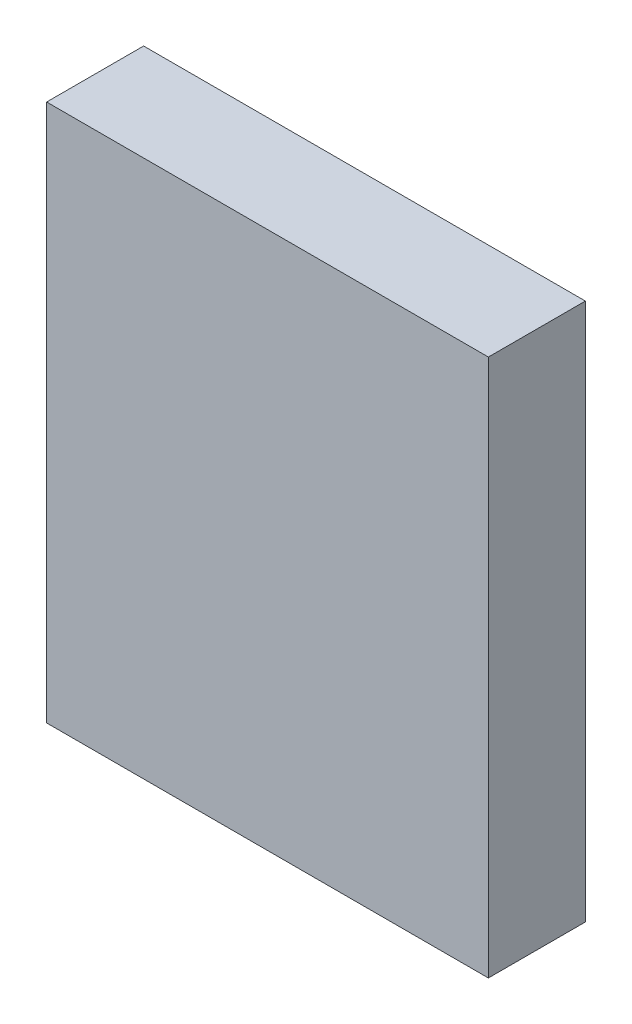
ISO-10303-21;
HEADER;
FILE_DESCRIPTION(('STEP AP214'),'2;1');
FILE_NAME('part.step','',(''),(''),'','','');
FILE_SCHEMA(('AUTOMOTIVE_DESIGN { 1 0 10303 214 1 1 1 1 }'));
ENDSEC;
DATA;
#1=APPLICATION_CONTEXT('core data for automotive mechanical design processes');
#2=APPLICATION_PROTOCOL_DEFINITION('international standard','automotive_design',2000,#1);
#3=PRODUCT_CONTEXT('',#1,'mechanical');
#4=PRODUCT('Part','Part','',(#3));
#5=PRODUCT_RELATED_PRODUCT_CATEGORY('part','',(#4));
#6=PRODUCT_DEFINITION_FORMATION('','',#4);
#7=PRODUCT_DEFINITION_CONTEXT('part definition',#1,'design');
#8=PRODUCT_DEFINITION('design','',#6,#7);
#9=PRODUCT_DEFINITION_SHAPE('','',#8);
#10=(LENGTH_UNIT() NAMED_UNIT(*) SI_UNIT(.MILLI.,.METRE.));
#11=(NAMED_UNIT(*) PLANE_ANGLE_UNIT() SI_UNIT($,.RADIAN.));
#12=(NAMED_UNIT(*) SI_UNIT($,.STERADIAN.) SOLID_ANGLE_UNIT());
#13=UNCERTAINTY_MEASURE_WITH_UNIT(LENGTH_MEASURE(1.E-05),#10,'distance_accuracy_value','');
#14=(GEOMETRIC_REPRESENTATION_CONTEXT(3) GLOBAL_UNCERTAINTY_ASSIGNED_CONTEXT((#13)) GLOBAL_UNIT_ASSIGNED_CONTEXT((#10,
#11,#12)) REPRESENTATION_CONTEXT('',''));
#15=CARTESIAN_POINT('',(0.,0.,0.));
#16=DIRECTION('',(0.,0.,1.));
#17=DIRECTION('',(1.,0.,0.));
#18=AXIS2_PLACEMENT_3D('',#15,#16,#17);
#19=CARTESIAN_POINT('',(0.,0.,10.1));
#20=DIRECTION('',(1.,0.,0.));
#21=DIRECTION('',(0.,0.,-1.));
#22=AXIS2_PLACEMENT_3D('',#19,#20,#21);
#23=PLANE('',#22);
#24=DIRECTION('',(0.,-1.,0.));
#25=VECTOR('',#24,1.);
#26=CARTESIAN_POINT('',(0.,0.,0.));
#27=LINE('',#26,#25);
#28=CARTESIAN_POINT('',(0.,56.,0.));
#29=VERTEX_POINT('',#28);
#30=CARTESIAN_POINT('',(0.,0.,0.));
#31=VERTEX_POINT('',#30);
#32=EDGE_CURVE('E107',#29,#31,#27,.T.);
#33=ORIENTED_EDGE('',*,*,#32,.T.);
#34=DIRECTION('',(0.,0.,-1.));
#35=VECTOR('',#34,1.);
#36=CARTESIAN_POINT('',(0.,0.,10.1));
#37=LINE('',#36,#35);
#38=CARTESIAN_POINT('',(0.,0.,10.1));
#39=VERTEX_POINT('',#38);
#40=EDGE_CURVE('E11',#39,#31,#37,.T.);
#41=ORIENTED_EDGE('',*,*,#40,.F.);
#42=DIRECTION('',(0.,-1.,0.));
#43=VECTOR('',#42,1.);
#44=CARTESIAN_POINT('',(0.,0.,10.1));
#45=LINE('',#44,#43);
#46=CARTESIAN_POINT('',(0.,56.,10.1));
#47=VERTEX_POINT('',#46);
#48=EDGE_CURVE('E91',#47,#39,#45,.T.);
#49=ORIENTED_EDGE('',*,*,#48,.F.);
#50=DIRECTION('',(0.,0.,-1.));
#51=VECTOR('',#50,1.);
#52=CARTESIAN_POINT('',(0.,56.,10.1));
#53=LINE('',#52,#51);
#54=EDGE_CURVE('E103',#47,#29,#53,.T.);
#55=ORIENTED_EDGE('',*,*,#54,.T.);
#56=EDGE_LOOP('',(#33,#41,#49,#55));
#57=FACE_BOUND('',#56,.T.);
#58=ADVANCED_FACE('F39',(#57),#23,.F.);
#59=CARTESIAN_POINT('',(0.,0.,10.1));
#60=DIRECTION('',(0.,1.,0.));
#61=DIRECTION('',(0.,0.,1.));
#62=AXIS2_PLACEMENT_3D('',#59,#60,#61);
#63=PLANE('',#62);
#64=DIRECTION('',(1.,0.,0.));
#65=VECTOR('',#64,1.);
#66=CARTESIAN_POINT('',(0.,0.,0.));
#67=LINE('',#66,#65);
#68=CARTESIAN_POINT('',(46.,0.,0.));
#69=VERTEX_POINT('',#68);
#70=EDGE_CURVE('E96',#31,#69,#67,.T.);
#71=ORIENTED_EDGE('',*,*,#70,.T.);
#72=DIRECTION('',(0.,0.,-1.));
#73=VECTOR('',#72,1.);
#74=CARTESIAN_POINT('',(46.,0.,10.1));
#75=LINE('',#74,#73);
#76=CARTESIAN_POINT('',(46.,0.,10.1));
#77=VERTEX_POINT('',#76);
#78=EDGE_CURVE('E48',#77,#69,#75,.T.);
#79=ORIENTED_EDGE('',*,*,#78,.F.);
#80=DIRECTION('',(1.,0.,0.));
#81=VECTOR('',#80,1.);
#82=CARTESIAN_POINT('',(0.,0.,10.1));
#83=LINE('',#82,#81);
#84=EDGE_CURVE('E86',#39,#77,#83,.T.);
#85=ORIENTED_EDGE('',*,*,#84,.F.);
#86=ORIENTED_EDGE('',*,*,#40,.T.);
#87=EDGE_LOOP('',(#71,#79,#85,#86));
#88=FACE_BOUND('',#87,.T.);
#89=ADVANCED_FACE('F95',(#88),#63,.F.);
#90=CARTESIAN_POINT('',(46.,0.,10.1));
#91=DIRECTION('',(-1.,0.,0.));
#92=DIRECTION('',(0.,-1.,0.));
#93=AXIS2_PLACEMENT_3D('',#90,#91,#92);
#94=PLANE('',#93);
#95=DIRECTION('',(0.,1.,0.));
#96=VECTOR('',#95,1.);
#97=CARTESIAN_POINT('',(46.,0.,0.));
#98=LINE('',#97,#96);
#99=CARTESIAN_POINT('',(46.,56.,0.));
#100=VERTEX_POINT('',#99);
#101=EDGE_CURVE('E73',#69,#100,#98,.T.);
#102=ORIENTED_EDGE('',*,*,#101,.T.);
#103=DIRECTION('',(0.,0.,-1.));
#104=VECTOR('',#103,1.);
#105=CARTESIAN_POINT('',(46.,56.,10.1));
#106=LINE('',#105,#104);
#107=CARTESIAN_POINT('',(46.,56.,10.1));
#108=VERTEX_POINT('',#107);
#109=EDGE_CURVE('E98',#108,#100,#106,.T.);
#110=ORIENTED_EDGE('',*,*,#109,.F.);
#111=DIRECTION('',(0.,1.,0.));
#112=VECTOR('',#111,1.);
#113=CARTESIAN_POINT('',(46.,0.,10.1));
#114=LINE('',#113,#112);
#115=EDGE_CURVE('E89',#77,#108,#114,.T.);
#116=ORIENTED_EDGE('',*,*,#115,.F.);
#117=ORIENTED_EDGE('',*,*,#78,.T.);
#118=EDGE_LOOP('',(#102,#110,#116,#117));
#119=FACE_BOUND('',#118,.T.);
#120=ADVANCED_FACE('F99',(#119),#94,.F.);
#121=CARTESIAN_POINT('',(0.,56.,10.1));
#122=DIRECTION('',(0.,-1.,0.));
#123=DIRECTION('',(0.,0.,-1.));
#124=AXIS2_PLACEMENT_3D('',#121,#122,#123);
#125=PLANE('',#124);
#126=DIRECTION('',(-1.,0.,0.));
#127=VECTOR('',#126,1.);
#128=CARTESIAN_POINT('',(0.,56.,0.));
#129=LINE('',#128,#127);
#130=EDGE_CURVE('E79',#100,#29,#129,.T.);
#131=ORIENTED_EDGE('',*,*,#130,.T.);
#132=ORIENTED_EDGE('',*,*,#54,.F.);
#133=DIRECTION('',(-1.,0.,0.));
#134=VECTOR('',#133,1.);
#135=CARTESIAN_POINT('',(0.,56.,10.1));
#136=LINE('',#135,#134);
#137=EDGE_CURVE('E56',#108,#47,#136,.T.);
#138=ORIENTED_EDGE('',*,*,#137,.F.);
#139=ORIENTED_EDGE('',*,*,#109,.T.);
#140=EDGE_LOOP('',(#131,#132,#138,#139));
#141=FACE_BOUND('',#140,.T.);
#142=ADVANCED_FACE('F120',(#141),#125,.F.);
#143=CARTESIAN_POINT('',(0.,0.,10.1));
#144=DIRECTION('',(0.,0.,-1.));
#145=DIRECTION('',(-1.,0.,0.));
#146=AXIS2_PLACEMENT_3D('',#143,#144,#145);
#147=PLANE('',#146);
#148=ORIENTED_EDGE('',*,*,#48,.T.);
#149=ORIENTED_EDGE('',*,*,#84,.T.);
#150=ORIENTED_EDGE('',*,*,#115,.T.);
#151=ORIENTED_EDGE('',*,*,#137,.T.);
#152=EDGE_LOOP('',(#148,#149,#150,#151));
#153=FACE_BOUND('',#152,.T.);
#154=ADVANCED_FACE('F87',(#153),#147,.F.);
#155=CARTESIAN_POINT('',(0.,0.,0.));
#156=DIRECTION('',(0.,0.,-1.));
#157=DIRECTION('',(-1.,0.,0.));
#158=AXIS2_PLACEMENT_3D('',#155,#156,#157);
#159=PLANE('',#158);
#160=ORIENTED_EDGE('',*,*,#32,.F.);
#161=ORIENTED_EDGE('',*,*,#130,.F.);
#162=ORIENTED_EDGE('',*,*,#101,.F.);
#163=ORIENTED_EDGE('',*,*,#70,.F.);
#164=EDGE_LOOP('',(#160,#161,#162,#163));
#165=FACE_BOUND('',#164,.T.);
#166=ADVANCED_FACE('F123',(#165),#159,.T.);
#167=CLOSED_SHELL('',(#58,#89,#120,#142,#154,#166));
#168=MANIFOLD_SOLID_BREP('B2',#167);
#169=ADVANCED_BREP_SHAPE_REPRESENTATION('',(#18,#168),#14);
#170=SHAPE_DEFINITION_REPRESENTATION(#9,#169);
ENDSEC;
END-ISO-10303-21;
